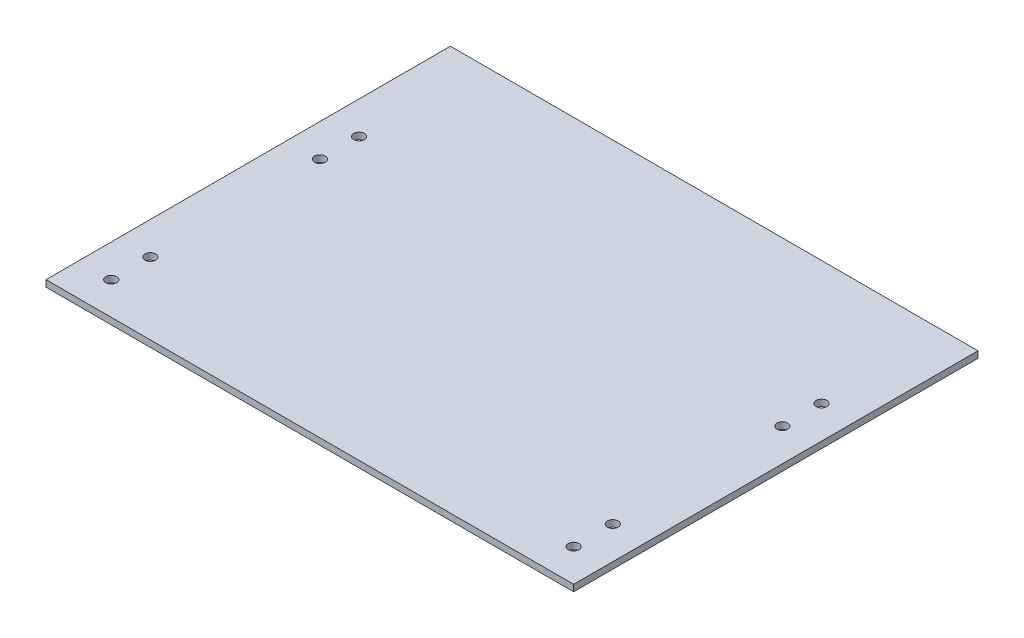
ISO-10303-21;
HEADER;
FILE_DESCRIPTION(('STEP AP214'),'2;1');
FILE_NAME('part.step','',(''),(''),'','','');
FILE_SCHEMA(('AUTOMOTIVE_DESIGN { 1 0 10303 214 1 1 1 1 }'));
ENDSEC;
DATA;
#1=APPLICATION_CONTEXT('core data for automotive mechanical design processes');
#2=APPLICATION_PROTOCOL_DEFINITION('international standard','automotive_design',2000,#1);
#3=PRODUCT_CONTEXT('',#1,'mechanical');
#4=PRODUCT('Part','Part','',(#3));
#5=PRODUCT_RELATED_PRODUCT_CATEGORY('part','',(#4));
#6=PRODUCT_DEFINITION_FORMATION('','',#4);
#7=PRODUCT_DEFINITION_CONTEXT('part definition',#1,'design');
#8=PRODUCT_DEFINITION('design','',#6,#7);
#9=PRODUCT_DEFINITION_SHAPE('','',#8);
#10=(LENGTH_UNIT() NAMED_UNIT(*) SI_UNIT(.MILLI.,.METRE.));
#11=(NAMED_UNIT(*) PLANE_ANGLE_UNIT() SI_UNIT($,.RADIAN.));
#12=(NAMED_UNIT(*) SI_UNIT($,.STERADIAN.) SOLID_ANGLE_UNIT());
#13=UNCERTAINTY_MEASURE_WITH_UNIT(LENGTH_MEASURE(1.E-05),#10,'distance_accuracy_value','');
#14=(GEOMETRIC_REPRESENTATION_CONTEXT(3) GLOBAL_UNCERTAINTY_ASSIGNED_CONTEXT((#13)) GLOBAL_UNIT_ASSIGNED_CONTEXT((#10,
#11,#12)) REPRESENTATION_CONTEXT('',''));
#15=CARTESIAN_POINT('',(0.,0.,0.));
#16=DIRECTION('',(0.,0.,1.));
#17=DIRECTION('',(1.,0.,0.));
#18=AXIS2_PLACEMENT_3D('',#15,#16,#17);
#19=CARTESIAN_POINT('',(0.,2.,0.));
#20=DIRECTION('',(0.,1.,0.));
#21=DIRECTION('',(0.,0.,1.));
#22=AXIS2_PLACEMENT_3D('',#19,#20,#21);
#23=PLANE('',#22);
#24=CARTESIAN_POINT('',(70.8999999999997,2.,26.));
#25=DIRECTION('',(0.,1.,0.));
#26=DIRECTION('',(0.,0.,-1.));
#27=AXIS2_PLACEMENT_3D('',#24,#25,#26);
#28=CIRCLE('',#27,1.65);
#29=CARTESIAN_POINT('',(70.8999999999997,2.,24.35));
#30=VERTEX_POINT('',#29);
#31=EDGE_CURVE('E146',#30,#30,#28,.T.);
#32=ORIENTED_EDGE('',*,*,#31,.F.);
#33=EDGE_LOOP('',(#32));
#34=FACE_BOUND('',#33,.T.);
#35=CARTESIAN_POINT('',(70.9000000000004,2.,-38.));
#36=DIRECTION('',(0.,1.,0.));
#37=DIRECTION('',(0.,0.,-1.));
#38=AXIS2_PLACEMENT_3D('',#35,#36,#37);
#39=CIRCLE('',#38,1.65);
#40=CARTESIAN_POINT('',(70.9000000000004,2.,-39.65));
#41=VERTEX_POINT('',#40);
#42=EDGE_CURVE('E134',#41,#41,#39,.T.);
#43=ORIENTED_EDGE('',*,*,#42,.F.);
#44=EDGE_LOOP('',(#43));
#45=FACE_BOUND('',#44,.T.);
#46=CARTESIAN_POINT('',(-70.8999999999997,2.,26.));
#47=DIRECTION('',(0.,1.,0.));
#48=DIRECTION('',(0.,0.,1.));
#49=AXIS2_PLACEMENT_3D('',#46,#47,#48);
#50=CIRCLE('',#49,1.65);
#51=CARTESIAN_POINT('',(-70.8999999999997,2.,27.65));
#52=VERTEX_POINT('',#51);
#53=EDGE_CURVE('E122',#52,#52,#50,.T.);
#54=ORIENTED_EDGE('',*,*,#53,.F.);
#55=EDGE_LOOP('',(#54));
#56=FACE_BOUND('',#55,.T.);
#57=CARTESIAN_POINT('',(-70.9000000000004,2.,-38.));
#58=DIRECTION('',(0.,1.,0.));
#59=DIRECTION('',(0.,0.,1.));
#60=AXIS2_PLACEMENT_3D('',#57,#58,#59);
#61=CIRCLE('',#60,1.65);
#62=CARTESIAN_POINT('',(-70.9000000000004,2.,-36.35));
#63=VERTEX_POINT('',#62);
#64=EDGE_CURVE('E101',#63,#63,#61,.T.);
#65=ORIENTED_EDGE('',*,*,#64,.F.);
#66=EDGE_LOOP('',(#65));
#67=FACE_BOUND('',#66,.T.);
#68=DIRECTION('',(0.,0.,1.));
#69=VECTOR('',#68,1.);
#70=CARTESIAN_POINT('',(-80.9000000000004,2.,-76.));
#71=LINE('',#70,#69);
#72=CARTESIAN_POINT('',(-80.9000000000004,2.,-76.));
#73=VERTEX_POINT('',#72);
#74=CARTESIAN_POINT('',(-80.9000000000004,2.,48.));
#75=VERTEX_POINT('',#74);
#76=EDGE_CURVE('E86',#73,#75,#71,.T.);
#77=ORIENTED_EDGE('',*,*,#76,.T.);
#78=DIRECTION('',(1.,0.,0.));
#79=VECTOR('',#78,1.);
#80=CARTESIAN_POINT('',(-80.9000000000004,2.,48.));
#81=LINE('',#80,#79);
#82=CARTESIAN_POINT('',(80.9000000000004,2.,48.));
#83=VERTEX_POINT('',#82);
#84=EDGE_CURVE('E81',#75,#83,#81,.T.);
#85=ORIENTED_EDGE('',*,*,#84,.T.);
#86=DIRECTION('',(0.,0.,-1.));
#87=VECTOR('',#86,1.);
#88=CARTESIAN_POINT('',(80.9000000000004,2.,-76.));
#89=LINE('',#88,#87);
#90=CARTESIAN_POINT('',(80.9000000000004,2.,-76.));
#91=VERTEX_POINT('',#90);
#92=EDGE_CURVE('E84',#83,#91,#89,.T.);
#93=ORIENTED_EDGE('',*,*,#92,.T.);
#94=DIRECTION('',(-1.,0.,0.));
#95=VECTOR('',#94,1.);
#96=CARTESIAN_POINT('',(-80.9000000000004,2.,-76.));
#97=LINE('',#96,#95);
#98=EDGE_CURVE('E51',#91,#73,#97,.T.);
#99=ORIENTED_EDGE('',*,*,#98,.T.);
#100=EDGE_LOOP('',(#77,#85,#93,#99));
#101=FACE_BOUND('',#100,.T.);
#102=CARTESIAN_POINT('',(-70.8999999999997,2.,-26.));
#103=DIRECTION('',(0.,1.,0.));
#104=DIRECTION('',(0.,0.,1.));
#105=AXIS2_PLACEMENT_3D('',#102,#103,#104);
#106=CIRCLE('',#105,1.65);
#107=CARTESIAN_POINT('',(-70.8999999999997,2.,-24.35));
#108=VERTEX_POINT('',#107);
#109=EDGE_CURVE('E116',#108,#108,#106,.T.);
#110=ORIENTED_EDGE('',*,*,#109,.F.);
#111=EDGE_LOOP('',(#110));
#112=FACE_BOUND('',#111,.T.);
#113=CARTESIAN_POINT('',(-70.8999999999991,2.,38.));
#114=DIRECTION('',(0.,1.,0.));
#115=DIRECTION('',(0.,0.,1.));
#116=AXIS2_PLACEMENT_3D('',#113,#114,#115);
#117=CIRCLE('',#116,1.65);
#118=CARTESIAN_POINT('',(-70.8999999999991,2.,39.65));
#119=VERTEX_POINT('',#118);
#120=EDGE_CURVE('E128',#119,#119,#117,.T.);
#121=ORIENTED_EDGE('',*,*,#120,.F.);
#122=EDGE_LOOP('',(#121));
#123=FACE_BOUND('',#122,.T.);
#124=CARTESIAN_POINT('',(70.8999999999997,2.,-26.));
#125=DIRECTION('',(0.,1.,0.));
#126=DIRECTION('',(0.,0.,-1.));
#127=AXIS2_PLACEMENT_3D('',#124,#125,#126);
#128=CIRCLE('',#127,1.65);
#129=CARTESIAN_POINT('',(70.8999999999997,2.,-27.65));
#130=VERTEX_POINT('',#129);
#131=EDGE_CURVE('E140',#130,#130,#128,.T.);
#132=ORIENTED_EDGE('',*,*,#131,.F.);
#133=EDGE_LOOP('',(#132));
#134=FACE_BOUND('',#133,.T.);
#135=CARTESIAN_POINT('',(70.8999999999991,2.,38.));
#136=DIRECTION('',(0.,1.,0.));
#137=DIRECTION('',(0.,0.,-1.));
#138=AXIS2_PLACEMENT_3D('',#135,#136,#137);
#139=CIRCLE('',#138,1.65);
#140=CARTESIAN_POINT('',(70.8999999999991,2.,36.35));
#141=VERTEX_POINT('',#140);
#142=EDGE_CURVE('E152',#141,#141,#139,.T.);
#143=ORIENTED_EDGE('',*,*,#142,.F.);
#144=EDGE_LOOP('',(#143));
#145=FACE_BOUND('',#144,.T.);
#146=ADVANCED_FACE('F34',(#34,#45,#56,#67,#101,#112,#123,#134,#145),#23,.T.);
#147=CARTESIAN_POINT('',(0.,0.,0.));
#148=DIRECTION('',(0.,1.,0.));
#149=DIRECTION('',(0.,0.,1.));
#150=AXIS2_PLACEMENT_3D('',#147,#148,#149);
#151=PLANE('',#150);
#152=DIRECTION('',(0.,0.,1.));
#153=VECTOR('',#152,1.);
#154=CARTESIAN_POINT('',(-80.9000000000004,0.,-76.));
#155=LINE('',#154,#153);
#156=CARTESIAN_POINT('',(-80.9000000000004,0.,-76.));
#157=VERTEX_POINT('',#156);
#158=CARTESIAN_POINT('',(-80.9000000000004,0.,48.));
#159=VERTEX_POINT('',#158);
#160=EDGE_CURVE('E98',#157,#159,#155,.T.);
#161=ORIENTED_EDGE('',*,*,#160,.F.);
#162=DIRECTION('',(-1.,0.,0.));
#163=VECTOR('',#162,1.);
#164=CARTESIAN_POINT('',(-80.9000000000004,0.,-76.));
#165=LINE('',#164,#163);
#166=CARTESIAN_POINT('',(80.9000000000004,0.,-76.));
#167=VERTEX_POINT('',#166);
#168=EDGE_CURVE('E74',#167,#157,#165,.T.);
#169=ORIENTED_EDGE('',*,*,#168,.F.);
#170=DIRECTION('',(0.,0.,-1.));
#171=VECTOR('',#170,1.);
#172=CARTESIAN_POINT('',(80.9000000000004,0.,-76.));
#173=LINE('',#172,#171);
#174=CARTESIAN_POINT('',(80.9000000000004,0.,48.));
#175=VERTEX_POINT('',#174);
#176=EDGE_CURVE('E68',#175,#167,#173,.T.);
#177=ORIENTED_EDGE('',*,*,#176,.F.);
#178=DIRECTION('',(1.,0.,0.));
#179=VECTOR('',#178,1.);
#180=CARTESIAN_POINT('',(-80.9000000000004,0.,48.));
#181=LINE('',#180,#179);
#182=EDGE_CURVE('E90',#159,#175,#181,.T.);
#183=ORIENTED_EDGE('',*,*,#182,.F.);
#184=EDGE_LOOP('',(#161,#169,#177,#183));
#185=FACE_BOUND('',#184,.T.);
#186=CARTESIAN_POINT('',(-70.9000000000004,0.,-38.));
#187=DIRECTION('',(0.,1.,0.));
#188=DIRECTION('',(0.,0.,1.));
#189=AXIS2_PLACEMENT_3D('',#186,#187,#188);
#190=CIRCLE('',#189,1.65);
#191=CARTESIAN_POINT('',(-70.9000000000004,0.,-36.35));
#192=VERTEX_POINT('',#191);
#193=EDGE_CURVE('E113',#192,#192,#190,.T.);
#194=ORIENTED_EDGE('',*,*,#193,.T.);
#195=EDGE_LOOP('',(#194));
#196=FACE_BOUND('',#195,.T.);
#197=CARTESIAN_POINT('',(-70.8999999999997,0.,-26.));
#198=DIRECTION('',(0.,1.,0.));
#199=DIRECTION('',(0.,0.,1.));
#200=AXIS2_PLACEMENT_3D('',#197,#198,#199);
#201=CIRCLE('',#200,1.65);
#202=CARTESIAN_POINT('',(-70.8999999999997,0.,-24.35));
#203=VERTEX_POINT('',#202);
#204=EDGE_CURVE('E119',#203,#203,#201,.T.);
#205=ORIENTED_EDGE('',*,*,#204,.T.);
#206=EDGE_LOOP('',(#205));
#207=FACE_BOUND('',#206,.T.);
#208=CARTESIAN_POINT('',(-70.8999999999997,0.,26.));
#209=DIRECTION('',(0.,1.,0.));
#210=DIRECTION('',(0.,0.,1.));
#211=AXIS2_PLACEMENT_3D('',#208,#209,#210);
#212=CIRCLE('',#211,1.65);
#213=CARTESIAN_POINT('',(-70.8999999999997,0.,27.65));
#214=VERTEX_POINT('',#213);
#215=EDGE_CURVE('E125',#214,#214,#212,.T.);
#216=ORIENTED_EDGE('',*,*,#215,.T.);
#217=EDGE_LOOP('',(#216));
#218=FACE_BOUND('',#217,.T.);
#219=CARTESIAN_POINT('',(-70.8999999999991,0.,38.));
#220=DIRECTION('',(0.,1.,0.));
#221=DIRECTION('',(0.,0.,1.));
#222=AXIS2_PLACEMENT_3D('',#219,#220,#221);
#223=CIRCLE('',#222,1.65);
#224=CARTESIAN_POINT('',(-70.8999999999991,0.,39.65));
#225=VERTEX_POINT('',#224);
#226=EDGE_CURVE('E131',#225,#225,#223,.T.);
#227=ORIENTED_EDGE('',*,*,#226,.T.);
#228=EDGE_LOOP('',(#227));
#229=FACE_BOUND('',#228,.T.);
#230=CARTESIAN_POINT('',(70.9000000000004,0.,-38.));
#231=DIRECTION('',(0.,1.,0.));
#232=DIRECTION('',(0.,0.,-1.));
#233=AXIS2_PLACEMENT_3D('',#230,#231,#232);
#234=CIRCLE('',#233,1.65);
#235=CARTESIAN_POINT('',(70.9000000000004,0.,-39.65));
#236=VERTEX_POINT('',#235);
#237=EDGE_CURVE('E137',#236,#236,#234,.T.);
#238=ORIENTED_EDGE('',*,*,#237,.T.);
#239=EDGE_LOOP('',(#238));
#240=FACE_BOUND('',#239,.T.);
#241=CARTESIAN_POINT('',(70.8999999999997,0.,-26.));
#242=DIRECTION('',(0.,1.,0.));
#243=DIRECTION('',(0.,0.,-1.));
#244=AXIS2_PLACEMENT_3D('',#241,#242,#243);
#245=CIRCLE('',#244,1.65);
#246=CARTESIAN_POINT('',(70.8999999999997,0.,-27.65));
#247=VERTEX_POINT('',#246);
#248=EDGE_CURVE('E143',#247,#247,#245,.T.);
#249=ORIENTED_EDGE('',*,*,#248,.T.);
#250=EDGE_LOOP('',(#249));
#251=FACE_BOUND('',#250,.T.);
#252=CARTESIAN_POINT('',(70.8999999999997,0.,26.));
#253=DIRECTION('',(0.,1.,0.));
#254=DIRECTION('',(0.,0.,-1.));
#255=AXIS2_PLACEMENT_3D('',#252,#253,#254);
#256=CIRCLE('',#255,1.65);
#257=CARTESIAN_POINT('',(70.8999999999997,0.,24.35));
#258=VERTEX_POINT('',#257);
#259=EDGE_CURVE('E149',#258,#258,#256,.T.);
#260=ORIENTED_EDGE('',*,*,#259,.T.);
#261=EDGE_LOOP('',(#260));
#262=FACE_BOUND('',#261,.T.);
#263=CARTESIAN_POINT('',(70.8999999999991,0.,38.));
#264=DIRECTION('',(0.,1.,0.));
#265=DIRECTION('',(0.,0.,-1.));
#266=AXIS2_PLACEMENT_3D('',#263,#264,#265);
#267=CIRCLE('',#266,1.65);
#268=CARTESIAN_POINT('',(70.8999999999991,0.,36.35));
#269=VERTEX_POINT('',#268);
#270=EDGE_CURVE('E155',#269,#269,#267,.T.);
#271=ORIENTED_EDGE('',*,*,#270,.T.);
#272=EDGE_LOOP('',(#271));
#273=FACE_BOUND('',#272,.T.);
#274=ADVANCED_FACE('F109',(#185,#196,#207,#218,#229,#240,#251,#262,#273),#151,.F.);
#275=CARTESIAN_POINT('',(-80.9000000000004,2.,-76.));
#276=DIRECTION('',(1.,0.,0.));
#277=DIRECTION('',(0.,0.,-1.));
#278=AXIS2_PLACEMENT_3D('',#275,#276,#277);
#279=PLANE('',#278);
#280=ORIENTED_EDGE('',*,*,#160,.T.);
#281=DIRECTION('',(0.,-1.,0.));
#282=VECTOR('',#281,1.);
#283=CARTESIAN_POINT('',(-80.9000000000004,2.,48.));
#284=LINE('',#283,#282);
#285=EDGE_CURVE('E11',#75,#159,#284,.T.);
#286=ORIENTED_EDGE('',*,*,#285,.F.);
#287=ORIENTED_EDGE('',*,*,#76,.F.);
#288=DIRECTION('',(0.,-1.,0.));
#289=VECTOR('',#288,1.);
#290=CARTESIAN_POINT('',(-80.9000000000004,2.,-76.));
#291=LINE('',#290,#289);
#292=EDGE_CURVE('E94',#73,#157,#291,.T.);
#293=ORIENTED_EDGE('',*,*,#292,.T.);
#294=EDGE_LOOP('',(#280,#286,#287,#293));
#295=FACE_BOUND('',#294,.T.);
#296=ADVANCED_FACE('F36',(#295),#279,.F.);
#297=CARTESIAN_POINT('',(-80.9000000000004,2.,48.));
#298=DIRECTION('',(0.,0.,-1.));
#299=DIRECTION('',(-1.,0.,0.));
#300=AXIS2_PLACEMENT_3D('',#297,#298,#299);
#301=PLANE('',#300);
#302=ORIENTED_EDGE('',*,*,#182,.T.);
#303=DIRECTION('',(0.,-1.,0.));
#304=VECTOR('',#303,1.);
#305=CARTESIAN_POINT('',(80.9000000000004,2.,48.));
#306=LINE('',#305,#304);
#307=EDGE_CURVE('E43',#83,#175,#306,.T.);
#308=ORIENTED_EDGE('',*,*,#307,.F.);
#309=ORIENTED_EDGE('',*,*,#84,.F.);
#310=ORIENTED_EDGE('',*,*,#285,.T.);
#311=EDGE_LOOP('',(#302,#308,#309,#310));
#312=FACE_BOUND('',#311,.T.);
#313=ADVANCED_FACE('F89',(#312),#301,.F.);
#314=CARTESIAN_POINT('',(80.9000000000004,2.,-76.));
#315=DIRECTION('',(-1.,0.,0.));
#316=DIRECTION('',(0.,0.,1.));
#317=AXIS2_PLACEMENT_3D('',#314,#315,#316);
#318=PLANE('',#317);
#319=ORIENTED_EDGE('',*,*,#176,.T.);
#320=DIRECTION('',(0.,-1.,0.));
#321=VECTOR('',#320,1.);
#322=CARTESIAN_POINT('',(80.9000000000004,2.,-76.));
#323=LINE('',#322,#321);
#324=EDGE_CURVE('E91',#91,#167,#323,.T.);
#325=ORIENTED_EDGE('',*,*,#324,.F.);
#326=ORIENTED_EDGE('',*,*,#92,.F.);
#327=ORIENTED_EDGE('',*,*,#307,.T.);
#328=EDGE_LOOP('',(#319,#325,#326,#327));
#329=FACE_BOUND('',#328,.T.);
#330=ADVANCED_FACE('F92',(#329),#318,.F.);
#331=CARTESIAN_POINT('',(-80.9000000000004,2.,-76.));
#332=DIRECTION('',(0.,0.,1.));
#333=DIRECTION('',(1.,0.,0.));
#334=AXIS2_PLACEMENT_3D('',#331,#332,#333);
#335=PLANE('',#334);
#336=ORIENTED_EDGE('',*,*,#168,.T.);
#337=ORIENTED_EDGE('',*,*,#292,.F.);
#338=ORIENTED_EDGE('',*,*,#98,.F.);
#339=ORIENTED_EDGE('',*,*,#324,.T.);
#340=EDGE_LOOP('',(#336,#337,#338,#339));
#341=FACE_BOUND('',#340,.T.);
#342=ADVANCED_FACE('F106',(#341),#335,.F.);
#343=CARTESIAN_POINT('',(-70.9000000000004,2.,-38.));
#344=DIRECTION('',(0.,-1.,0.));
#345=DIRECTION('',(0.,0.,-1.));
#346=AXIS2_PLACEMENT_3D('',#343,#344,#345);
#347=CYLINDRICAL_SURFACE('',#346,1.65);
#348=ORIENTED_EDGE('',*,*,#64,.T.);
#349=EDGE_LOOP('',(#348));
#350=FACE_BOUND('',#349,.T.);
#351=ORIENTED_EDGE('',*,*,#193,.F.);
#352=EDGE_LOOP('',(#351));
#353=FACE_BOUND('',#352,.T.);
#354=ADVANCED_FACE('F174',(#350,#353),#347,.F.);
#355=CARTESIAN_POINT('',(-70.8999999999997,2.,-26.));
#356=DIRECTION('',(0.,-1.,0.));
#357=DIRECTION('',(0.,0.,-1.));
#358=AXIS2_PLACEMENT_3D('',#355,#356,#357);
#359=CYLINDRICAL_SURFACE('',#358,1.65);
#360=ORIENTED_EDGE('',*,*,#109,.T.);
#361=EDGE_LOOP('',(#360));
#362=FACE_BOUND('',#361,.T.);
#363=ORIENTED_EDGE('',*,*,#204,.F.);
#364=EDGE_LOOP('',(#363));
#365=FACE_BOUND('',#364,.T.);
#366=ADVANCED_FACE('F220',(#362,#365),#359,.F.);
#367=CARTESIAN_POINT('',(-70.8999999999997,2.,26.));
#368=DIRECTION('',(0.,-1.,0.));
#369=DIRECTION('',(0.,0.,-1.));
#370=AXIS2_PLACEMENT_3D('',#367,#368,#369);
#371=CYLINDRICAL_SURFACE('',#370,1.65);
#372=ORIENTED_EDGE('',*,*,#53,.T.);
#373=EDGE_LOOP('',(#372));
#374=FACE_BOUND('',#373,.T.);
#375=ORIENTED_EDGE('',*,*,#215,.F.);
#376=EDGE_LOOP('',(#375));
#377=FACE_BOUND('',#376,.T.);
#378=ADVANCED_FACE('F228',(#374,#377),#371,.F.);
#379=CARTESIAN_POINT('',(-70.8999999999991,2.,38.));
#380=DIRECTION('',(0.,-1.,0.));
#381=DIRECTION('',(0.,0.,-1.));
#382=AXIS2_PLACEMENT_3D('',#379,#380,#381);
#383=CYLINDRICAL_SURFACE('',#382,1.65);
#384=ORIENTED_EDGE('',*,*,#120,.T.);
#385=EDGE_LOOP('',(#384));
#386=FACE_BOUND('',#385,.T.);
#387=ORIENTED_EDGE('',*,*,#226,.F.);
#388=EDGE_LOOP('',(#387));
#389=FACE_BOUND('',#388,.T.);
#390=ADVANCED_FACE('F236',(#386,#389),#383,.F.);
#391=CARTESIAN_POINT('',(70.9000000000004,2.,-38.));
#392=DIRECTION('',(0.,-1.,0.));
#393=DIRECTION('',(0.,0.,-1.));
#394=AXIS2_PLACEMENT_3D('',#391,#392,#393);
#395=CYLINDRICAL_SURFACE('',#394,1.65);
#396=ORIENTED_EDGE('',*,*,#42,.T.);
#397=EDGE_LOOP('',(#396));
#398=FACE_BOUND('',#397,.T.);
#399=ORIENTED_EDGE('',*,*,#237,.F.);
#400=EDGE_LOOP('',(#399));
#401=FACE_BOUND('',#400,.T.);
#402=ADVANCED_FACE('F245',(#398,#401),#395,.F.);
#403=CARTESIAN_POINT('',(70.8999999999997,2.,-26.));
#404=DIRECTION('',(0.,-1.,0.));
#405=DIRECTION('',(0.,0.,-1.));
#406=AXIS2_PLACEMENT_3D('',#403,#404,#405);
#407=CYLINDRICAL_SURFACE('',#406,1.65);
#408=ORIENTED_EDGE('',*,*,#131,.T.);
#409=EDGE_LOOP('',(#408));
#410=FACE_BOUND('',#409,.T.);
#411=ORIENTED_EDGE('',*,*,#248,.F.);
#412=EDGE_LOOP('',(#411));
#413=FACE_BOUND('',#412,.T.);
#414=ADVANCED_FACE('F254',(#410,#413),#407,.F.);
#415=CARTESIAN_POINT('',(70.8999999999997,2.,26.));
#416=DIRECTION('',(0.,-1.,0.));
#417=DIRECTION('',(0.,0.,-1.));
#418=AXIS2_PLACEMENT_3D('',#415,#416,#417);
#419=CYLINDRICAL_SURFACE('',#418,1.65);
#420=ORIENTED_EDGE('',*,*,#31,.T.);
#421=EDGE_LOOP('',(#420));
#422=FACE_BOUND('',#421,.T.);
#423=ORIENTED_EDGE('',*,*,#259,.F.);
#424=EDGE_LOOP('',(#423));
#425=FACE_BOUND('',#424,.T.);
#426=ADVANCED_FACE('F263',(#422,#425),#419,.F.);
#427=CARTESIAN_POINT('',(70.8999999999991,2.,38.));
#428=DIRECTION('',(0.,-1.,0.));
#429=DIRECTION('',(0.,0.,-1.));
#430=AXIS2_PLACEMENT_3D('',#427,#428,#429);
#431=CYLINDRICAL_SURFACE('',#430,1.65);
#432=ORIENTED_EDGE('',*,*,#142,.T.);
#433=EDGE_LOOP('',(#432));
#434=FACE_BOUND('',#433,.T.);
#435=ORIENTED_EDGE('',*,*,#270,.F.);
#436=EDGE_LOOP('',(#435));
#437=FACE_BOUND('',#436,.T.);
#438=ADVANCED_FACE('F161',(#434,#437),#431,.F.);
#439=CLOSED_SHELL('',(#146,#274,#296,#313,#330,#342,#354,#366,#378,#390,#402,#414,#426,#438));
#440=MANIFOLD_SOLID_BREP('B2',#439);
#441=ADVANCED_BREP_SHAPE_REPRESENTATION('',(#18,#440),#14);
#442=SHAPE_DEFINITION_REPRESENTATION(#9,#441);
ENDSEC;
END-ISO-10303-21;
